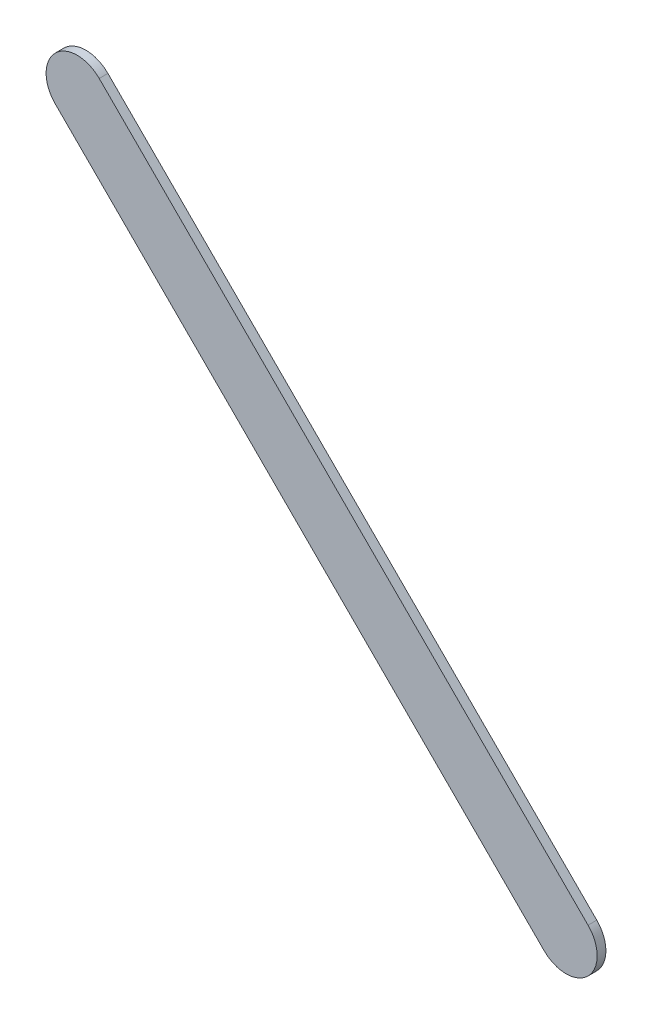
ISO-10303-21;
HEADER;
FILE_DESCRIPTION(('STEP AP214'),'2;1');
FILE_NAME('part.step','',(''),(''),'','','');
FILE_SCHEMA(('AUTOMOTIVE_DESIGN { 1 0 10303 214 1 1 1 1 }'));
ENDSEC;
DATA;
#1=APPLICATION_CONTEXT('core data for automotive mechanical design processes');
#2=APPLICATION_PROTOCOL_DEFINITION('international standard','automotive_design',2000,#1);
#3=PRODUCT_CONTEXT('',#1,'mechanical');
#4=PRODUCT('Part','Part','',(#3));
#5=PRODUCT_RELATED_PRODUCT_CATEGORY('part','',(#4));
#6=PRODUCT_DEFINITION_FORMATION('','',#4);
#7=PRODUCT_DEFINITION_CONTEXT('part definition',#1,'design');
#8=PRODUCT_DEFINITION('design','',#6,#7);
#9=PRODUCT_DEFINITION_SHAPE('','',#8);
#10=(LENGTH_UNIT() NAMED_UNIT(*) SI_UNIT(.MILLI.,.METRE.));
#11=(NAMED_UNIT(*) PLANE_ANGLE_UNIT() SI_UNIT($,.RADIAN.));
#12=(NAMED_UNIT(*) SI_UNIT($,.STERADIAN.) SOLID_ANGLE_UNIT());
#13=UNCERTAINTY_MEASURE_WITH_UNIT(LENGTH_MEASURE(1.E-05),#10,'distance_accuracy_value','');
#14=(GEOMETRIC_REPRESENTATION_CONTEXT(3) GLOBAL_UNCERTAINTY_ASSIGNED_CONTEXT((#13)) GLOBAL_UNIT_ASSIGNED_CONTEXT((#10,
#11,#12)) REPRESENTATION_CONTEXT('',''));
#15=CARTESIAN_POINT('',(0.,0.,0.));
#16=DIRECTION('',(0.,0.,1.));
#17=DIRECTION('',(1.,0.,0.));
#18=AXIS2_PLACEMENT_3D('',#15,#16,#17);
#19=CARTESIAN_POINT('',(85.53498768,94.79717134,0.));
#20=DIRECTION('',(0.70710678118655,0.707106781186545,0.));
#21=DIRECTION('',(0.707106781186545,-0.70710678118655,0.));
#22=AXIS2_PLACEMENT_3D('',#19,#20,#21);
#23=PLANE('',#22);
#24=DIRECTION('',(0.707106781186545,-0.70710678118655,0.));
#25=VECTOR('',#24,1.);
#26=CARTESIAN_POINT('',(85.53498768,94.79717134,0.03556));
#27=LINE('',#26,#25);
#28=CARTESIAN_POINT('',(85.53498768,94.79717134,0.03556));
#29=VERTEX_POINT('',#28);
#30=CARTESIAN_POINT('',(87.5312067,92.80095232,0.03556));
#31=VERTEX_POINT('',#30);
#32=EDGE_CURVE('E11',#29,#31,#27,.T.);
#33=ORIENTED_EDGE('',*,*,#32,.F.);
#34=DIRECTION('',(0.,0.,1.));
#35=VECTOR('',#34,1.);
#36=CARTESIAN_POINT('',(85.53498768,94.79717134,0.));
#37=LINE('',#36,#35);
#38=CARTESIAN_POINT('',(85.53498768,94.79717134,0.));
#39=VERTEX_POINT('',#38);
#40=EDGE_CURVE('E24',#39,#29,#37,.T.);
#41=ORIENTED_EDGE('',*,*,#40,.F.);
#42=DIRECTION('',(0.707106781186545,-0.70710678118655,0.));
#43=VECTOR('',#42,1.);
#44=CARTESIAN_POINT('',(85.53498768,94.79717134,0.));
#45=LINE('',#44,#43);
#46=CARTESIAN_POINT('',(87.5312067,92.80095232,0.));
#47=VERTEX_POINT('',#46);
#48=EDGE_CURVE('E75',#39,#47,#45,.T.);
#49=ORIENTED_EDGE('',*,*,#48,.T.);
#50=DIRECTION('',(0.,0.,1.));
#51=VECTOR('',#50,1.);
#52=CARTESIAN_POINT('',(87.5312067,92.80095232,0.));
#53=LINE('',#52,#51);
#54=EDGE_CURVE('E37',#47,#31,#53,.T.);
#55=ORIENTED_EDGE('',*,*,#54,.T.);
#56=EDGE_LOOP('',(#33,#41,#49,#55));
#57=FACE_BOUND('',#56,.T.);
#58=ADVANCED_FACE('F17',(#57),#23,.F.);
#59=CARTESIAN_POINT('',(87.62100967,92.89075529,0.));
#60=DIRECTION('',(0.,0.,-1.));
#61=DIRECTION('',(-0.707106781186604,-0.707106781186492,0.));
#62=AXIS2_PLACEMENT_3D('',#59,#60,#61);
#63=CYLINDRICAL_SURFACE('',#62,0.127000578115382);
#64=CARTESIAN_POINT('',(87.62100967,92.89075529,0.03556));
#65=DIRECTION('',(0.,0.,1.));
#66=DIRECTION('',(-0.707106781186604,-0.707106781186492,0.));
#67=AXIS2_PLACEMENT_3D('',#64,#65,#66);
#68=CIRCLE('',#67,0.127000578115382);
#69=CARTESIAN_POINT('',(87.71081264,92.98055826,0.03556));
#70=VERTEX_POINT('',#69);
#71=EDGE_CURVE('E83',#31,#70,#68,.T.);
#72=ORIENTED_EDGE('',*,*,#71,.F.);
#73=ORIENTED_EDGE('',*,*,#54,.F.);
#74=CARTESIAN_POINT('',(87.62100967,92.89075529,0.));
#75=DIRECTION('',(0.,0.,1.));
#76=DIRECTION('',(-0.707106781186604,-0.707106781186492,0.));
#77=AXIS2_PLACEMENT_3D('',#74,#75,#76);
#78=CIRCLE('',#77,0.127000578115382);
#79=CARTESIAN_POINT('',(87.71081264,92.98055826,0.));
#80=VERTEX_POINT('',#79);
#81=EDGE_CURVE('E81',#47,#80,#78,.T.);
#82=ORIENTED_EDGE('',*,*,#81,.T.);
#83=DIRECTION('',(0.,0.,1.));
#84=VECTOR('',#83,1.);
#85=CARTESIAN_POINT('',(87.71081264,92.98055826,0.));
#86=LINE('',#85,#84);
#87=EDGE_CURVE('E67',#80,#70,#86,.T.);
#88=ORIENTED_EDGE('',*,*,#87,.T.);
#89=EDGE_LOOP('',(#72,#73,#82,#88));
#90=FACE_BOUND('',#89,.T.);
#91=ADVANCED_FACE('F89',(#90),#63,.T.);
#92=CARTESIAN_POINT('',(87.71081264,92.98055826,0.));
#93=DIRECTION('',(-0.707106781186548,-0.707106781186548,0.));
#94=DIRECTION('',(-0.707106781186548,0.707106781186548,0.));
#95=AXIS2_PLACEMENT_3D('',#92,#93,#94);
#96=PLANE('',#95);
#97=DIRECTION('',(-0.707106781186548,0.707106781186548,0.));
#98=VECTOR('',#97,1.);
#99=CARTESIAN_POINT('',(87.71081264,92.98055826,0.03556));
#100=LINE('',#99,#98);
#101=CARTESIAN_POINT('',(85.71459362,94.97677728,0.03556));
#102=VERTEX_POINT('',#101);
#103=EDGE_CURVE('E71',#70,#102,#100,.T.);
#104=ORIENTED_EDGE('',*,*,#103,.F.);
#105=ORIENTED_EDGE('',*,*,#87,.F.);
#106=DIRECTION('',(-0.707106781186548,0.707106781186548,0.));
#107=VECTOR('',#106,1.);
#108=CARTESIAN_POINT('',(87.71081264,92.98055826,0.));
#109=LINE('',#108,#107);
#110=CARTESIAN_POINT('',(85.71459362,94.97677728,0.));
#111=VERTEX_POINT('',#110);
#112=EDGE_CURVE('E63',#80,#111,#109,.T.);
#113=ORIENTED_EDGE('',*,*,#112,.T.);
#114=DIRECTION('',(0.,0.,1.));
#115=VECTOR('',#114,1.);
#116=CARTESIAN_POINT('',(85.71459362,94.97677728,0.));
#117=LINE('',#116,#115);
#118=EDGE_CURVE('E53',#111,#102,#117,.T.);
#119=ORIENTED_EDGE('',*,*,#118,.T.);
#120=EDGE_LOOP('',(#104,#105,#113,#119));
#121=FACE_BOUND('',#120,.T.);
#122=ADVANCED_FACE('F66',(#121),#96,.F.);
#123=CARTESIAN_POINT('',(85.62479065,94.88697431,0.));
#124=DIRECTION('',(0.,0.,-1.));
#125=DIRECTION('',(0.707106781186604,0.707106781186492,0.));
#126=AXIS2_PLACEMENT_3D('',#123,#124,#125);
#127=CYLINDRICAL_SURFACE('',#126,0.127000578115379);
#128=CARTESIAN_POINT('',(85.62479065,94.88697431,0.03556));
#129=DIRECTION('',(0.,0.,1.));
#130=DIRECTION('',(0.707106781186604,0.707106781186492,0.));
#131=AXIS2_PLACEMENT_3D('',#128,#129,#130);
#132=CIRCLE('',#131,0.127000578115379);
#133=EDGE_CURVE('E59',#102,#29,#132,.T.);
#134=ORIENTED_EDGE('',*,*,#133,.F.);
#135=ORIENTED_EDGE('',*,*,#118,.F.);
#136=CARTESIAN_POINT('',(85.62479065,94.88697431,0.));
#137=DIRECTION('',(0.,0.,1.));
#138=DIRECTION('',(0.707106781186604,0.707106781186492,0.));
#139=AXIS2_PLACEMENT_3D('',#136,#137,#138);
#140=CIRCLE('',#139,0.127000578115379);
#141=EDGE_CURVE('E57',#111,#39,#140,.T.);
#142=ORIENTED_EDGE('',*,*,#141,.T.);
#143=ORIENTED_EDGE('',*,*,#40,.T.);
#144=EDGE_LOOP('',(#134,#135,#142,#143));
#145=FACE_BOUND('',#144,.T.);
#146=ADVANCED_FACE('F55',(#145),#127,.T.);
#147=CARTESIAN_POINT('',(85.53498768,94.79717134,0.));
#148=DIRECTION('',(0.,0.,-1.));
#149=DIRECTION('',(-1.,0.,0.));
#150=AXIS2_PLACEMENT_3D('',#147,#148,#149);
#151=PLANE('',#150);
#152=ORIENTED_EDGE('',*,*,#141,.F.);
#153=ORIENTED_EDGE('',*,*,#112,.F.);
#154=ORIENTED_EDGE('',*,*,#81,.F.);
#155=ORIENTED_EDGE('',*,*,#48,.F.);
#156=EDGE_LOOP('',(#152,#153,#154,#155));
#157=FACE_BOUND('',#156,.T.);
#158=ADVANCED_FACE('F74',(#157),#151,.T.);
#159=CARTESIAN_POINT('',(85.53498768,94.79717134,0.03556));
#160=DIRECTION('',(0.,0.,-1.));
#161=DIRECTION('',(-1.,0.,0.));
#162=AXIS2_PLACEMENT_3D('',#159,#160,#161);
#163=PLANE('',#162);
#164=ORIENTED_EDGE('',*,*,#32,.T.);
#165=ORIENTED_EDGE('',*,*,#71,.T.);
#166=ORIENTED_EDGE('',*,*,#103,.T.);
#167=ORIENTED_EDGE('',*,*,#133,.T.);
#168=EDGE_LOOP('',(#164,#165,#166,#167));
#169=FACE_BOUND('',#168,.T.);
#170=ADVANCED_FACE('F91',(#169),#163,.F.);
#171=CLOSED_SHELL('',(#58,#91,#122,#146,#158,#170));
#172=MANIFOLD_SOLID_BREP('B1',#171);
#173=ADVANCED_BREP_SHAPE_REPRESENTATION('',(#18,#172),#14);
#174=SHAPE_DEFINITION_REPRESENTATION(#9,#173);
ENDSEC;
END-ISO-10303-21;
